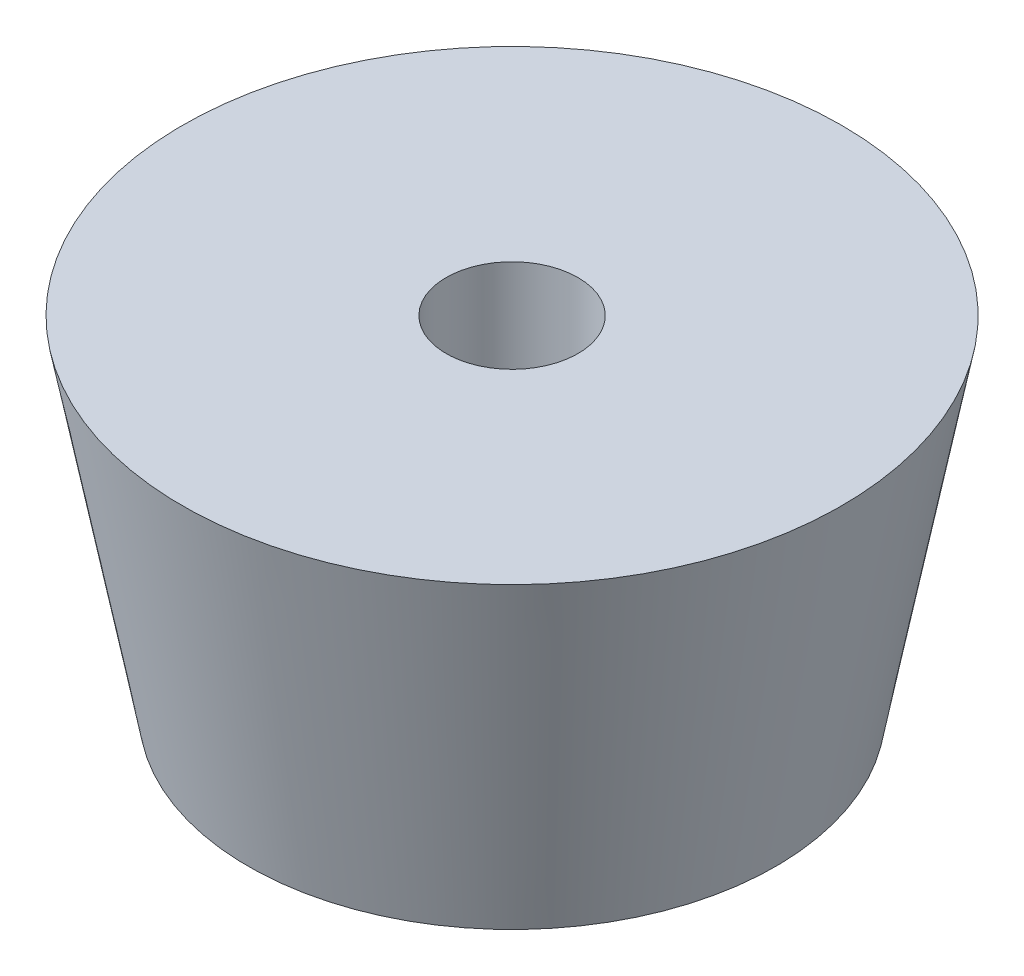
ISO-10303-21;
HEADER;
FILE_DESCRIPTION(('STEP AP214'),'2;1');
FILE_NAME('part.step','',(''),(''),'','','');
FILE_SCHEMA(('AUTOMOTIVE_DESIGN { 1 0 10303 214 1 1 1 1 }'));
ENDSEC;
DATA;
#1=APPLICATION_CONTEXT('core data for automotive mechanical design processes');
#2=APPLICATION_PROTOCOL_DEFINITION('international standard','automotive_design',2000,#1);
#3=PRODUCT_CONTEXT('',#1,'mechanical');
#4=PRODUCT('Part','Part','',(#3));
#5=PRODUCT_RELATED_PRODUCT_CATEGORY('part','',(#4));
#6=PRODUCT_DEFINITION_FORMATION('','',#4);
#7=PRODUCT_DEFINITION_CONTEXT('part definition',#1,'design');
#8=PRODUCT_DEFINITION('design','',#6,#7);
#9=PRODUCT_DEFINITION_SHAPE('','',#8);
#10=(LENGTH_UNIT() NAMED_UNIT(*) SI_UNIT(.MILLI.,.METRE.));
#11=(NAMED_UNIT(*) PLANE_ANGLE_UNIT() SI_UNIT($,.RADIAN.));
#12=(NAMED_UNIT(*) SI_UNIT($,.STERADIAN.) SOLID_ANGLE_UNIT());
#13=UNCERTAINTY_MEASURE_WITH_UNIT(LENGTH_MEASURE(1.E-05),#10,'distance_accuracy_value','');
#14=(GEOMETRIC_REPRESENTATION_CONTEXT(3) GLOBAL_UNCERTAINTY_ASSIGNED_CONTEXT((#13)) GLOBAL_UNIT_ASSIGNED_CONTEXT((#10,
#11,#12)) REPRESENTATION_CONTEXT('',''));
#15=CARTESIAN_POINT('',(0.,0.,0.));
#16=DIRECTION('',(0.,0.,1.));
#17=DIRECTION('',(1.,0.,0.));
#18=AXIS2_PLACEMENT_3D('',#15,#16,#17);
#19=CARTESIAN_POINT('',(0.,7.85811682275086,0.));
#20=DIRECTION('',(0.,-1.,0.));
#21=DIRECTION('',(0.,0.,-1.));
#22=AXIS2_PLACEMENT_3D('',#19,#20,#21);
#23=CYLINDRICAL_SURFACE('',#22,1.5);
#24=CARTESIAN_POINT('',(0.,7.85811682275086,0.));
#25=DIRECTION('',(0.,-1.,0.));
#26=DIRECTION('',(0.,0.,-1.));
#27=AXIS2_PLACEMENT_3D('',#24,#25,#26);
#28=CIRCLE('',#27,1.5);
#29=CARTESIAN_POINT('',(0.,7.85811682275086,-1.5));
#30=VERTEX_POINT('',#29);
#31=EDGE_CURVE('E45',#30,#30,#28,.T.);
#32=ORIENTED_EDGE('',*,*,#31,.F.);
#33=EDGE_LOOP('',(#32));
#34=FACE_BOUND('',#33,.T.);
#35=CARTESIAN_POINT('',(0.,5.,0.));
#36=DIRECTION('',(0.,-1.,0.));
#37=DIRECTION('',(0.,0.,-1.));
#38=AXIS2_PLACEMENT_3D('',#35,#36,#37);
#39=CIRCLE('',#38,1.5);
#40=CARTESIAN_POINT('',(0.,5.,-1.5));
#41=VERTEX_POINT('',#40);
#42=EDGE_CURVE('E37',#41,#41,#39,.F.);
#43=ORIENTED_EDGE('',*,*,#42,.F.);
#44=EDGE_LOOP('',(#43));
#45=FACE_BOUND('',#44,.T.);
#46=ADVANCED_FACE('F33',(#34,#45),#23,.F.);
#47=CARTESIAN_POINT('',(0.,7.85811682275086,0.));
#48=DIRECTION('',(0.,1.,0.));
#49=DIRECTION('',(0.,0.,1.));
#50=AXIS2_PLACEMENT_3D('',#47,#48,#49);
#51=PLANE('',#50);
#52=ORIENTED_EDGE('',*,*,#31,.T.);
#53=EDGE_LOOP('',(#52));
#54=FACE_BOUND('',#53,.T.);
#55=CARTESIAN_POINT('',(0.,7.85811682275086,0.));
#56=DIRECTION('',(0.,-1.,0.));
#57=DIRECTION('',(0.,0.,-1.));
#58=AXIS2_PLACEMENT_3D('',#55,#56,#57);
#59=CIRCLE('',#58,7.5);
#60=CARTESIAN_POINT('',(0.,7.85811682275086,-7.5));
#61=VERTEX_POINT('',#60);
#62=EDGE_CURVE('E10',#61,#61,#59,.T.);
#63=ORIENTED_EDGE('',*,*,#62,.F.);
#64=EDGE_LOOP('',(#63));
#65=FACE_BOUND('',#64,.T.);
#66=ADVANCED_FACE('F35',(#54,#65),#51,.T.);
#67=CARTESIAN_POINT('',(0.,0.,0.));
#68=DIRECTION('',(0.,1.,0.));
#69=DIRECTION('',(0.,0.,1.));
#70=AXIS2_PLACEMENT_3D('',#67,#68,#69);
#71=CONICAL_SURFACE('',#70,6.,0.188616386175404);
#72=ORIENTED_EDGE('',*,*,#62,.T.);
#73=EDGE_LOOP('',(#72));
#74=FACE_BOUND('',#73,.T.);
#75=CARTESIAN_POINT('',(0.,0.,0.));
#76=DIRECTION('',(0.,-1.,0.));
#77=DIRECTION('',(0.,0.,-1.));
#78=AXIS2_PLACEMENT_3D('',#75,#76,#77);
#79=CIRCLE('',#78,6.);
#80=CARTESIAN_POINT('',(0.,0.,-6.));
#81=VERTEX_POINT('',#80);
#82=EDGE_CURVE('E41',#81,#81,#79,.T.);
#83=ORIENTED_EDGE('',*,*,#82,.F.);
#84=EDGE_LOOP('',(#83));
#85=FACE_BOUND('',#84,.T.);
#86=ADVANCED_FACE('F68',(#74,#85),#71,.T.);
#87=CARTESIAN_POINT('',(0.,0.,0.));
#88=DIRECTION('',(0.,-1.,0.));
#89=DIRECTION('',(0.,0.,-1.));
#90=AXIS2_PLACEMENT_3D('',#87,#88,#89);
#91=PLANE('',#90);
#92=CARTESIAN_POINT('',(0.,0.,0.));
#93=DIRECTION('',(0.,-1.,0.));
#94=DIRECTION('',(0.,0.,-1.));
#95=AXIS2_PLACEMENT_3D('',#92,#93,#94);
#96=CIRCLE('',#95,3.5);
#97=CARTESIAN_POINT('',(0.,0.,-3.5));
#98=VERTEX_POINT('',#97);
#99=EDGE_CURVE('E50',#98,#98,#96,.T.);
#100=ORIENTED_EDGE('',*,*,#99,.F.);
#101=EDGE_LOOP('',(#100));
#102=FACE_BOUND('',#101,.T.);
#103=ORIENTED_EDGE('',*,*,#82,.T.);
#104=EDGE_LOOP('',(#103));
#105=FACE_BOUND('',#104,.T.);
#106=ADVANCED_FACE('F75',(#102,#105),#91,.T.);
#107=CARTESIAN_POINT('',(0.,5.,0.));
#108=DIRECTION('',(0.,-1.,0.));
#109=DIRECTION('',(0.,0.,-1.));
#110=AXIS2_PLACEMENT_3D('',#107,#108,#109);
#111=PLANE('',#110);
#112=CARTESIAN_POINT('',(0.,5.,0.));
#113=DIRECTION('',(0.,-1.,0.));
#114=DIRECTION('',(0.,0.,-1.));
#115=AXIS2_PLACEMENT_3D('',#112,#113,#114);
#116=CIRCLE('',#115,3.5);
#117=CARTESIAN_POINT('',(0.,5.,-3.5));
#118=VERTEX_POINT('',#117);
#119=EDGE_CURVE('E53',#118,#118,#116,.T.);
#120=ORIENTED_EDGE('',*,*,#119,.T.);
#121=EDGE_LOOP('',(#120));
#122=FACE_BOUND('',#121,.T.);
#123=ORIENTED_EDGE('',*,*,#42,.T.);
#124=EDGE_LOOP('',(#123));
#125=FACE_BOUND('',#124,.T.);
#126=ADVANCED_FACE('F60',(#122,#125),#111,.T.);
#127=CARTESIAN_POINT('',(0.,5.,0.));
#128=DIRECTION('',(0.,-1.,0.));
#129=DIRECTION('',(0.,0.,-1.));
#130=AXIS2_PLACEMENT_3D('',#127,#128,#129);
#131=CYLINDRICAL_SURFACE('',#130,3.5);
#132=ORIENTED_EDGE('',*,*,#119,.F.);
#133=EDGE_LOOP('',(#132));
#134=FACE_BOUND('',#133,.T.);
#135=ORIENTED_EDGE('',*,*,#99,.T.);
#136=EDGE_LOOP('',(#135));
#137=FACE_BOUND('',#136,.T.);
#138=ADVANCED_FACE('F73',(#134,#137),#131,.F.);
#139=CLOSED_SHELL('',(#46,#66,#86,#106,#126,#138));
#140=MANIFOLD_SOLID_BREP('B2',#139);
#141=ADVANCED_BREP_SHAPE_REPRESENTATION('',(#18,#140),#14);
#142=SHAPE_DEFINITION_REPRESENTATION(#9,#141);
ENDSEC;
END-ISO-10303-21;
